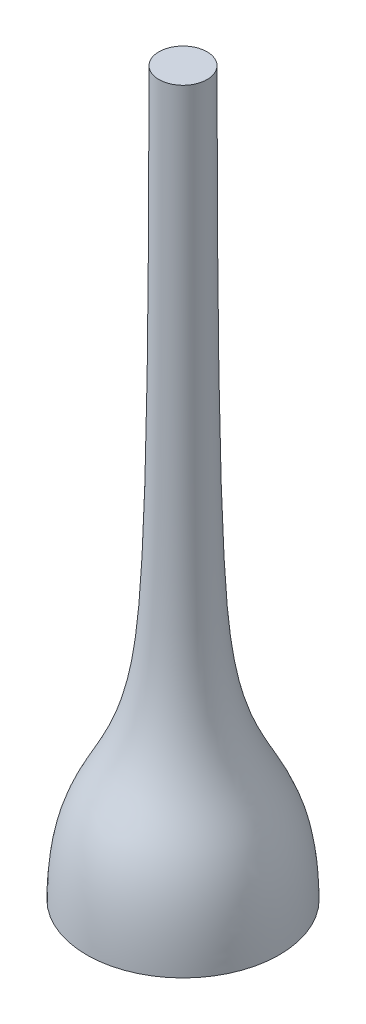
ISO-10303-21;
HEADER;
FILE_DESCRIPTION(('STEP AP214'),'2;1');
FILE_NAME('part.step','',(''),(''),'','','');
FILE_SCHEMA(('AUTOMOTIVE_DESIGN { 1 0 10303 214 1 1 1 1 }'));
ENDSEC;
DATA;
#1=APPLICATION_CONTEXT('core data for automotive mechanical design processes');
#2=APPLICATION_PROTOCOL_DEFINITION('international standard','automotive_design',2000,#1);
#3=PRODUCT_CONTEXT('',#1,'mechanical');
#4=PRODUCT('Part','Part','',(#3));
#5=PRODUCT_RELATED_PRODUCT_CATEGORY('part','',(#4));
#6=PRODUCT_DEFINITION_FORMATION('','',#4);
#7=PRODUCT_DEFINITION_CONTEXT('part definition',#1,'design');
#8=PRODUCT_DEFINITION('design','',#6,#7);
#9=PRODUCT_DEFINITION_SHAPE('','',#8);
#10=(LENGTH_UNIT() NAMED_UNIT(*) SI_UNIT(.MILLI.,.METRE.));
#11=(NAMED_UNIT(*) PLANE_ANGLE_UNIT() SI_UNIT($,.RADIAN.));
#12=(NAMED_UNIT(*) SI_UNIT($,.STERADIAN.) SOLID_ANGLE_UNIT());
#13=UNCERTAINTY_MEASURE_WITH_UNIT(LENGTH_MEASURE(1.E-05),#10,'distance_accuracy_value','');
#14=(GEOMETRIC_REPRESENTATION_CONTEXT(3) GLOBAL_UNCERTAINTY_ASSIGNED_CONTEXT((#13)) GLOBAL_UNIT_ASSIGNED_CONTEXT((#10,
#11,#12)) REPRESENTATION_CONTEXT('',''));
#15=CARTESIAN_POINT('',(0.,0.,0.));
#16=DIRECTION('',(0.,0.,1.));
#17=DIRECTION('',(1.,0.,0.));
#18=AXIS2_PLACEMENT_3D('',#15,#16,#17);
#19=CARTESIAN_POINT('',(0.,15.,0.));
#20=DIRECTION('',(0.,-1.,0.));
#21=DIRECTION('',(0.,0.,-1.));
#22=AXIS2_PLACEMENT_3D('',#19,#20,#21);
#23=PLANE('',#22);
#24=CARTESIAN_POINT('',(0.,15.,0.));
#25=DIRECTION('',(0.,1.,0.));
#26=DIRECTION('',(0.,0.,1.));
#27=AXIS2_PLACEMENT_3D('',#24,#25,#26);
#28=CIRCLE('',#27,0.5);
#29=CARTESIAN_POINT('',(0.,15.,0.5));
#30=VERTEX_POINT('',#29);
#31=EDGE_CURVE('E10',#30,#30,#28,.T.);
#32=ORIENTED_EDGE('',*,*,#31,.T.);
#33=EDGE_LOOP('',(#32));
#34=FACE_BOUND('',#33,.T.);
#35=ADVANCED_FACE('F31',(#34),#23,.F.);
#36=CARTESIAN_POINT('',(2.,0.,0.));
#37=CARTESIAN_POINT('',(1.96995028212624,2.3514531969424,0.));
#38=CARTESIAN_POINT('',(0.941978143292364,2.03355611013739,0.));
#39=CARTESIAN_POINT('',(0.571405700022448,5.99492601884955,0.));
#40=CARTESIAN_POINT('',(0.501667506782302,9.66079199707474,0.));
#41=CARTESIAN_POINT('',(0.5,15.,0.));
#42=B_SPLINE_CURVE_WITH_KNOTS('',3,(#36,#37,#38,#39,#40,#41),.UNSPECIFIED.,.F.,.F.,(4,1,1,4),
(0.,0.669768410961681,0.769768410961681,1.),.UNSPECIFIED.);
#43=CARTESIAN_POINT('',(0.,15.,0.));
#44=DIRECTION('',(0.,1.,0.));
#45=AXIS1_PLACEMENT('',#43,#44);
#46=SURFACE_OF_REVOLUTION('',#42,#45);
#47=ORIENTED_EDGE('',*,*,#31,.F.);
#48=EDGE_LOOP('',(#47));
#49=FACE_BOUND('',#48,.T.);
#50=CARTESIAN_POINT('',(0.,0.,0.));
#51=DIRECTION('',(0.,1.,0.));
#52=DIRECTION('',(0.,0.,1.));
#53=AXIS2_PLACEMENT_3D('',#50,#51,#52);
#54=CIRCLE('',#53,2.);
#55=CARTESIAN_POINT('',(0.,0.,2.));
#56=VERTEX_POINT('',#55);
#57=EDGE_CURVE('E37',#56,#56,#54,.T.);
#58=ORIENTED_EDGE('',*,*,#57,.T.);
#59=EDGE_LOOP('',(#58));
#60=FACE_BOUND('',#59,.T.);
#61=ADVANCED_FACE('F50',(#49,#60),#46,.T.);
#62=CARTESIAN_POINT('',(0.,0.,0.));
#63=DIRECTION('',(0.,1.,0.));
#64=DIRECTION('',(0.,0.,1.));
#65=AXIS2_PLACEMENT_3D('',#62,#63,#64);
#66=PLANE('',#65);
#67=ORIENTED_EDGE('',*,*,#57,.F.);
#68=EDGE_LOOP('',(#67));
#69=FACE_BOUND('',#68,.T.);
#70=ADVANCED_FACE('F53',(#69),#66,.F.);
#71=CLOSED_SHELL('',(#35,#61,#70));
#72=MANIFOLD_SOLID_BREP('B2',#71);
#73=ADVANCED_BREP_SHAPE_REPRESENTATION('',(#18,#72),#14);
#74=SHAPE_DEFINITION_REPRESENTATION(#9,#73);
ENDSEC;
END-ISO-10303-21;
